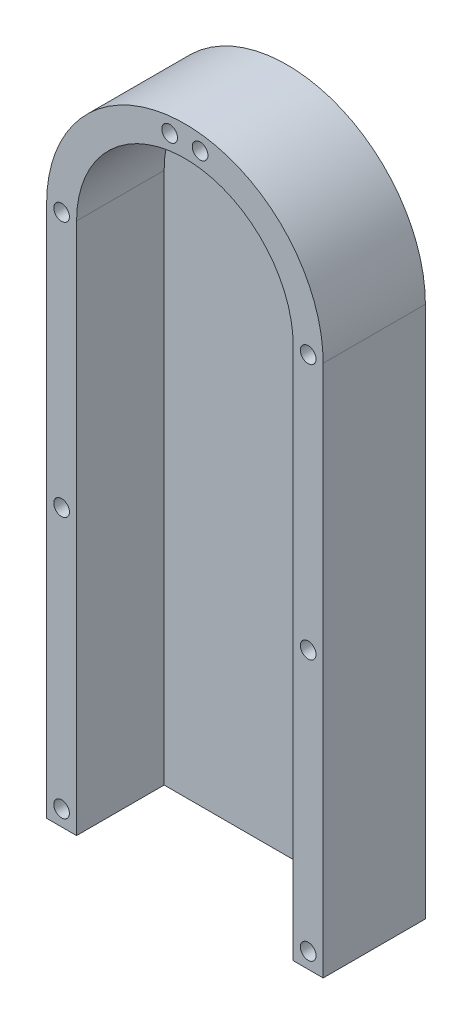
ISO-10303-21;
HEADER;
FILE_DESCRIPTION(('STEP AP214'),'2;1');
FILE_NAME('part.step','',(''),(''),'','','');
FILE_SCHEMA(('AUTOMOTIVE_DESIGN { 1 0 10303 214 1 1 1 1 }'));
ENDSEC;
DATA;
#1=APPLICATION_CONTEXT('core data for automotive mechanical design processes');
#2=APPLICATION_PROTOCOL_DEFINITION('international standard','automotive_design',2000,#1);
#3=PRODUCT_CONTEXT('',#1,'mechanical');
#4=PRODUCT('Part','Part','',(#3));
#5=PRODUCT_RELATED_PRODUCT_CATEGORY('part','',(#4));
#6=PRODUCT_DEFINITION_FORMATION('','',#4);
#7=PRODUCT_DEFINITION_CONTEXT('part definition',#1,'design');
#8=PRODUCT_DEFINITION('design','',#6,#7);
#9=PRODUCT_DEFINITION_SHAPE('','',#8);
#10=(LENGTH_UNIT() NAMED_UNIT(*) SI_UNIT(.MILLI.,.METRE.));
#11=(NAMED_UNIT(*) PLANE_ANGLE_UNIT() SI_UNIT($,.RADIAN.));
#12=(NAMED_UNIT(*) SI_UNIT($,.STERADIAN.) SOLID_ANGLE_UNIT());
#13=UNCERTAINTY_MEASURE_WITH_UNIT(LENGTH_MEASURE(1.E-05),#10,'distance_accuracy_value','');
#14=(GEOMETRIC_REPRESENTATION_CONTEXT(3) GLOBAL_UNCERTAINTY_ASSIGNED_CONTEXT((#13)) GLOBAL_UNIT_ASSIGNED_CONTEXT((#10,
#11,#12)) REPRESENTATION_CONTEXT('',''));
#15=CARTESIAN_POINT('',(0.,0.,0.));
#16=DIRECTION('',(0.,0.,1.));
#17=DIRECTION('',(1.,0.,0.));
#18=AXIS2_PLACEMENT_3D('',#15,#16,#17);
#19=CARTESIAN_POINT('',(24.5827179372451,-59.5829059297929,3.175));
#20=DIRECTION('',(0.,0.,1.));
#21=DIRECTION('',(1.,0.,0.));
#22=AXIS2_PLACEMENT_3D('',#19,#20,#21);
#23=PLANE('',#22);
#24=DIRECTION('',(0.,-1.,0.));
#25=VECTOR('',#24,1.);
#26=CARTESIAN_POINT('',(48.0827179372451,171.394622999198,3.175));
#27=LINE('',#26,#25);
#28=CARTESIAN_POINT('',(48.0827179372451,171.394622999198,3.175));
#29=VERTEX_POINT('',#28);
#30=CARTESIAN_POINT('',(48.0827179372451,55.9058585347025,3.175));
#31=VERTEX_POINT('',#30);
#32=EDGE_CURVE('E48',#29,#31,#27,.T.);
#33=ORIENTED_EDGE('',*,*,#32,.F.);
#34=CARTESIAN_POINT('',(24.5827179372451,171.394622999198,3.175));
#35=DIRECTION('',(0.,0.,-1.));
#36=DIRECTION('',(1.,0.,0.));
#37=AXIS2_PLACEMENT_3D('',#34,#35,#36);
#38=CIRCLE('',#37,23.5);
#39=CARTESIAN_POINT('',(1.08271793724509,171.394622999198,3.175));
#40=VERTEX_POINT('',#39);
#41=EDGE_CURVE('E126',#40,#29,#38,.T.);
#42=ORIENTED_EDGE('',*,*,#41,.F.);
#43=DIRECTION('',(0.,1.,0.));
#44=VECTOR('',#43,1.);
#45=CARTESIAN_POINT('',(1.08271793724509,171.394622999198,3.175));
#46=LINE('',#45,#44);
#47=CARTESIAN_POINT('',(1.08271793724509,55.9058585347025,3.175));
#48=VERTEX_POINT('',#47);
#49=EDGE_CURVE('E53',#48,#40,#46,.T.);
#50=ORIENTED_EDGE('',*,*,#49,.F.);
#51=DIRECTION('',(-1.,0.,0.));
#52=VECTOR('',#51,1.);
#53=CARTESIAN_POINT('',(-5.41728206275491,55.9058585347025,3.175));
#54=LINE('',#53,#52);
#55=EDGE_CURVE('E155',#31,#48,#54,.T.);
#56=ORIENTED_EDGE('',*,*,#55,.F.);
#57=EDGE_LOOP('',(#33,#42,#50,#56));
#58=FACE_BOUND('',#57,.T.);
#59=ADVANCED_FACE('F33',(#58),#23,.T.);
#60=CARTESIAN_POINT('',(24.5827179372451,-59.5829059297929,0.));
#61=DIRECTION('',(0.,0.,1.));
#62=DIRECTION('',(1.,0.,0.));
#63=AXIS2_PLACEMENT_3D('',#60,#61,#62);
#64=PLANE('',#63);
#65=DIRECTION('',(0.,1.,0.));
#66=VECTOR('',#65,1.);
#67=CARTESIAN_POINT('',(54.5827179372451,-59.5829059297929,0.));
#68=LINE('',#67,#66);
#69=CARTESIAN_POINT('',(54.5827179372451,55.9058585347025,0.));
#70=VERTEX_POINT('',#69);
#71=CARTESIAN_POINT('',(54.5827179372451,171.394622999198,0.));
#72=VERTEX_POINT('',#71);
#73=EDGE_CURVE('E183',#70,#72,#68,.T.);
#74=ORIENTED_EDGE('',*,*,#73,.F.);
#75=DIRECTION('',(-1.,0.,0.));
#76=VECTOR('',#75,1.);
#77=CARTESIAN_POINT('',(-5.41728206275491,55.9058585347025,0.));
#78=LINE('',#77,#76);
#79=CARTESIAN_POINT('',(-5.41728206275491,55.9058585347025,0.));
#80=VERTEX_POINT('',#79);
#81=EDGE_CURVE('E156',#70,#80,#78,.T.);
#82=ORIENTED_EDGE('',*,*,#81,.T.);
#83=DIRECTION('',(0.,-1.,0.));
#84=VECTOR('',#83,1.);
#85=CARTESIAN_POINT('',(-5.41728206275491,171.394622999198,0.));
#86=LINE('',#85,#84);
#87=CARTESIAN_POINT('',(-5.41728206275491,171.394622999198,0.));
#88=VERTEX_POINT('',#87);
#89=EDGE_CURVE('E104',#88,#80,#86,.T.);
#90=ORIENTED_EDGE('',*,*,#89,.F.);
#91=CARTESIAN_POINT('',(24.5827179372451,171.394622999198,0.));
#92=DIRECTION('',(0.,0.,1.));
#93=DIRECTION('',(1.,0.,0.));
#94=AXIS2_PLACEMENT_3D('',#91,#92,#93);
#95=CIRCLE('',#94,30.);
#96=EDGE_CURVE('E185',#72,#88,#95,.T.);
#97=ORIENTED_EDGE('',*,*,#96,.F.);
#98=EDGE_LOOP('',(#74,#82,#90,#97));
#99=FACE_BOUND('',#98,.T.);
#100=CARTESIAN_POINT('',(27.8827179372451,197.940291195723,0.));
#101=DIRECTION('',(0.,0.,1.));
#102=DIRECTION('',(1.,0.,0.));
#103=AXIS2_PLACEMENT_3D('',#100,#101,#102);
#104=CIRCLE('',#103,1.70000000000001);
#105=CARTESIAN_POINT('',(29.5827179372451,197.940291195723,0.));
#106=VERTEX_POINT('',#105);
#107=EDGE_CURVE('E180',#106,#106,#104,.T.);
#108=ORIENTED_EDGE('',*,*,#107,.T.);
#109=EDGE_LOOP('',(#108));
#110=FACE_BOUND('',#109,.T.);
#111=CARTESIAN_POINT('',(51.3327179372474,171.3946229992,0.));
#112=DIRECTION('',(0.,0.,1.));
#113=DIRECTION('',(1.,0.,0.));
#114=AXIS2_PLACEMENT_3D('',#111,#112,#113);
#115=CIRCLE('',#114,1.70000000000001);
#116=CARTESIAN_POINT('',(53.0327179372474,171.3946229992,0.));
#117=VERTEX_POINT('',#116);
#118=EDGE_CURVE('E177',#117,#117,#115,.T.);
#119=ORIENTED_EDGE('',*,*,#118,.T.);
#120=EDGE_LOOP('',(#119));
#121=FACE_BOUND('',#120,.T.);
#122=CARTESIAN_POINT('',(-2.1672820627549,59.3058585347025,0.));
#123=DIRECTION('',(0.,0.,1.));
#124=DIRECTION('',(1.,0.,0.));
#125=AXIS2_PLACEMENT_3D('',#122,#123,#124);
#126=CIRCLE('',#125,1.70000000000001);
#127=CARTESIAN_POINT('',(-0.46728206275489,59.3058585347025,0.));
#128=VERTEX_POINT('',#127);
#129=EDGE_CURVE('E174',#128,#128,#126,.T.);
#130=ORIENTED_EDGE('',*,*,#129,.T.);
#131=EDGE_LOOP('',(#130));
#132=FACE_BOUND('',#131,.T.);
#133=CARTESIAN_POINT('',(-2.16728206275266,171.394622999196,0.));
#134=DIRECTION('',(0.,0.,1.));
#135=DIRECTION('',(1.,0.,0.));
#136=AXIS2_PLACEMENT_3D('',#133,#134,#135);
#137=CIRCLE('',#136,1.70000000000001);
#138=CARTESIAN_POINT('',(-0.467282062752642,171.394622999196,0.));
#139=VERTEX_POINT('',#138);
#140=EDGE_CURVE('E171',#139,#139,#137,.T.);
#141=ORIENTED_EDGE('',*,*,#140,.T.);
#142=EDGE_LOOP('',(#141));
#143=FACE_BOUND('',#142,.T.);
#144=CARTESIAN_POINT('',(51.3327179372449,115.905858534703,0.));
#145=DIRECTION('',(0.,0.,1.));
#146=DIRECTION('',(1.,0.,0.));
#147=AXIS2_PLACEMENT_3D('',#144,#145,#146);
#148=CIRCLE('',#147,1.70000000000001);
#149=CARTESIAN_POINT('',(53.0327179372449,115.905858534703,0.));
#150=VERTEX_POINT('',#149);
#151=EDGE_CURVE('E168',#150,#150,#148,.T.);
#152=ORIENTED_EDGE('',*,*,#151,.T.);
#153=EDGE_LOOP('',(#152));
#154=FACE_BOUND('',#153,.T.);
#155=CARTESIAN_POINT('',(-2.16728206275513,115.905858534703,0.));
#156=DIRECTION('',(0.,0.,1.));
#157=DIRECTION('',(1.,0.,0.));
#158=AXIS2_PLACEMENT_3D('',#155,#156,#157);
#159=CIRCLE('',#158,1.70000000000001);
#160=CARTESIAN_POINT('',(-0.467282062755112,115.905858534703,0.));
#161=VERTEX_POINT('',#160);
#162=EDGE_CURVE('E165',#161,#161,#159,.T.);
#163=ORIENTED_EDGE('',*,*,#162,.T.);
#164=EDGE_LOOP('',(#163));
#165=FACE_BOUND('',#164,.T.);
#166=CARTESIAN_POINT('',(21.2827179372451,197.940291195723,0.));
#167=DIRECTION('',(0.,0.,1.));
#168=DIRECTION('',(1.,0.,0.));
#169=AXIS2_PLACEMENT_3D('',#166,#167,#168);
#170=CIRCLE('',#169,1.70000000000001);
#171=CARTESIAN_POINT('',(22.9827179372451,197.940291195723,0.));
#172=VERTEX_POINT('',#171);
#173=EDGE_CURVE('E162',#172,#172,#170,.T.);
#174=ORIENTED_EDGE('',*,*,#173,.T.);
#175=EDGE_LOOP('',(#174));
#176=FACE_BOUND('',#175,.T.);
#177=CARTESIAN_POINT('',(51.3327179372451,59.3058585347025,0.));
#178=DIRECTION('',(0.,0.,1.));
#179=DIRECTION('',(1.,0.,0.));
#180=AXIS2_PLACEMENT_3D('',#177,#178,#179);
#181=CIRCLE('',#180,1.7);
#182=CARTESIAN_POINT('',(53.0327179372451,59.3058585347025,0.));
#183=VERTEX_POINT('',#182);
#184=EDGE_CURVE('E107',#183,#183,#181,.T.);
#185=ORIENTED_EDGE('',*,*,#184,.T.);
#186=EDGE_LOOP('',(#185));
#187=FACE_BOUND('',#186,.T.);
#188=ADVANCED_FACE('F191',(#99,#110,#121,#132,#143,#154,#165,#176,#187),#64,.F.);
#189=CARTESIAN_POINT('',(54.5827179372451,-59.5829059297929,3.175));
#190=DIRECTION('',(-1.,0.,0.));
#191=DIRECTION('',(0.,0.,1.));
#192=AXIS2_PLACEMENT_3D('',#189,#190,#191);
#193=PLANE('',#192);
#194=DIRECTION('',(0.,0.,-1.));
#195=VECTOR('',#194,1.);
#196=CARTESIAN_POINT('',(54.5827179372451,171.394622999198,3.175));
#197=LINE('',#196,#195);
#198=CARTESIAN_POINT('',(54.5827179372451,171.394622999198,22.175));
#199=VERTEX_POINT('',#198);
#200=EDGE_CURVE('E11',#199,#72,#197,.T.);
#201=ORIENTED_EDGE('',*,*,#200,.F.);
#202=DIRECTION('',(0.,1.,0.));
#203=VECTOR('',#202,1.);
#204=CARTESIAN_POINT('',(54.5827179372451,55.9058585347025,22.175));
#205=LINE('',#204,#203);
#206=CARTESIAN_POINT('',(54.5827179372451,55.9058585347025,22.175));
#207=VERTEX_POINT('',#206);
#208=EDGE_CURVE('E140',#207,#199,#205,.T.);
#209=ORIENTED_EDGE('',*,*,#208,.F.);
#210=DIRECTION('',(0.,0.,1.));
#211=VECTOR('',#210,1.);
#212=CARTESIAN_POINT('',(54.5827179372451,55.9058585347025,0.));
#213=LINE('',#212,#211);
#214=EDGE_CURVE('E108',#70,#207,#213,.T.);
#215=ORIENTED_EDGE('',*,*,#214,.F.);
#216=ORIENTED_EDGE('',*,*,#73,.T.);
#217=EDGE_LOOP('',(#201,#209,#215,#216));
#218=FACE_BOUND('',#217,.T.);
#219=ADVANCED_FACE('F35',(#218),#193,.F.);
#220=CARTESIAN_POINT('',(24.5827179372451,171.394622999198,3.175));
#221=DIRECTION('',(0.,0.,-1.));
#222=DIRECTION('',(-1.,0.,0.));
#223=AXIS2_PLACEMENT_3D('',#220,#221,#222);
#224=CYLINDRICAL_SURFACE('',#223,30.);
#225=ORIENTED_EDGE('',*,*,#96,.T.);
#226=DIRECTION('',(0.,0.,-1.));
#227=VECTOR('',#226,1.);
#228=CARTESIAN_POINT('',(-5.41728206275491,171.394622999198,3.175));
#229=LINE('',#228,#227);
#230=CARTESIAN_POINT('',(-5.41728206275491,171.394622999198,22.175));
#231=VERTEX_POINT('',#230);
#232=EDGE_CURVE('E41',#231,#88,#229,.T.);
#233=ORIENTED_EDGE('',*,*,#232,.F.);
#234=CARTESIAN_POINT('',(24.5827179372451,171.394622999198,22.175));
#235=DIRECTION('',(0.,0.,1.));
#236=DIRECTION('',(1.,0.,0.));
#237=AXIS2_PLACEMENT_3D('',#234,#235,#236);
#238=CIRCLE('',#237,30.);
#239=EDGE_CURVE('E124',#199,#231,#238,.T.);
#240=ORIENTED_EDGE('',*,*,#239,.F.);
#241=ORIENTED_EDGE('',*,*,#200,.T.);
#242=EDGE_LOOP('',(#225,#233,#240,#241));
#243=FACE_BOUND('',#242,.T.);
#244=ADVANCED_FACE('F197',(#243),#224,.T.);
#245=CARTESIAN_POINT('',(-5.41728206275491,171.394622999198,3.175));
#246=DIRECTION('',(1.,0.,0.));
#247=DIRECTION('',(0.,0.,-1.));
#248=AXIS2_PLACEMENT_3D('',#245,#246,#247);
#249=PLANE('',#248);
#250=ORIENTED_EDGE('',*,*,#89,.T.);
#251=DIRECTION('',(0.,0.,1.));
#252=VECTOR('',#251,1.);
#253=CARTESIAN_POINT('',(-5.41728206275491,55.9058585347025,0.));
#254=LINE('',#253,#252);
#255=CARTESIAN_POINT('',(-5.41728206275491,55.9058585347025,22.175));
#256=VERTEX_POINT('',#255);
#257=EDGE_CURVE('E97',#80,#256,#254,.T.);
#258=ORIENTED_EDGE('',*,*,#257,.T.);
#259=DIRECTION('',(0.,-1.,0.));
#260=VECTOR('',#259,1.);
#261=CARTESIAN_POINT('',(-5.41728206275491,171.394622999198,22.175));
#262=LINE('',#261,#260);
#263=EDGE_CURVE('E102',#231,#256,#262,.T.);
#264=ORIENTED_EDGE('',*,*,#263,.F.);
#265=ORIENTED_EDGE('',*,*,#232,.T.);
#266=EDGE_LOOP('',(#250,#258,#264,#265));
#267=FACE_BOUND('',#266,.T.);
#268=ADVANCED_FACE('F99',(#267),#249,.F.);
#269=CARTESIAN_POINT('',(27.8827179372451,197.940291195723,3.175));
#270=DIRECTION('',(0.,0.,-1.));
#271=DIRECTION('',(-1.,0.,0.));
#272=AXIS2_PLACEMENT_3D('',#269,#270,#271);
#273=CYLINDRICAL_SURFACE('',#272,1.70000000000001);
#274=ORIENTED_EDGE('',*,*,#107,.F.);
#275=EDGE_LOOP('',(#274));
#276=FACE_BOUND('',#275,.T.);
#277=CARTESIAN_POINT('',(27.8827179372451,197.940291195723,22.175));
#278=DIRECTION('',(0.,0.,1.));
#279=DIRECTION('',(1.,0.,0.));
#280=AXIS2_PLACEMENT_3D('',#277,#278,#279);
#281=CIRCLE('',#280,1.70000000000001);
#282=CARTESIAN_POINT('',(29.5827179372451,197.940291195723,22.175));
#283=VERTEX_POINT('',#282);
#284=EDGE_CURVE('E286',#283,#283,#281,.T.);
#285=ORIENTED_EDGE('',*,*,#284,.T.);
#286=EDGE_LOOP('',(#285));
#287=FACE_BOUND('',#286,.T.);
#288=ADVANCED_FACE('F203',(#276,#287),#273,.F.);
#289=CARTESIAN_POINT('',(51.3327179372474,171.3946229992,3.175));
#290=DIRECTION('',(0.,0.,-1.));
#291=DIRECTION('',(-1.,0.,0.));
#292=AXIS2_PLACEMENT_3D('',#289,#290,#291);
#293=CYLINDRICAL_SURFACE('',#292,1.70000000000001);
#294=ORIENTED_EDGE('',*,*,#118,.F.);
#295=EDGE_LOOP('',(#294));
#296=FACE_BOUND('',#295,.T.);
#297=CARTESIAN_POINT('',(51.3327179372474,171.3946229992,22.175));
#298=DIRECTION('',(0.,0.,1.));
#299=DIRECTION('',(1.,0.,0.));
#300=AXIS2_PLACEMENT_3D('',#297,#298,#299);
#301=CIRCLE('',#300,1.70000000000001);
#302=CARTESIAN_POINT('',(53.0327179372474,171.3946229992,22.175));
#303=VERTEX_POINT('',#302);
#304=EDGE_CURVE('E268',#303,#303,#301,.T.);
#305=ORIENTED_EDGE('',*,*,#304,.T.);
#306=EDGE_LOOP('',(#305));
#307=FACE_BOUND('',#306,.T.);
#308=ADVANCED_FACE('F214',(#296,#307),#293,.F.);
#309=CARTESIAN_POINT('',(-2.1672820627549,59.3058585347025,3.175));
#310=DIRECTION('',(0.,0.,-1.));
#311=DIRECTION('',(-1.,0.,0.));
#312=AXIS2_PLACEMENT_3D('',#309,#310,#311);
#313=CYLINDRICAL_SURFACE('',#312,1.70000000000001);
#314=ORIENTED_EDGE('',*,*,#129,.F.);
#315=EDGE_LOOP('',(#314));
#316=FACE_BOUND('',#315,.T.);
#317=CARTESIAN_POINT('',(-2.1672820627549,59.3058585347025,22.175));
#318=DIRECTION('',(0.,0.,1.));
#319=DIRECTION('',(1.,0.,0.));
#320=AXIS2_PLACEMENT_3D('',#317,#318,#319);
#321=CIRCLE('',#320,1.70000000000002);
#322=CARTESIAN_POINT('',(-0.46728206275489,59.3058585347025,22.175));
#323=VERTEX_POINT('',#322);
#324=EDGE_CURVE('E276',#323,#323,#321,.T.);
#325=ORIENTED_EDGE('',*,*,#324,.T.);
#326=EDGE_LOOP('',(#325));
#327=FACE_BOUND('',#326,.T.);
#328=ADVANCED_FACE('F218',(#316,#327),#313,.F.);
#329=CARTESIAN_POINT('',(-2.16728206275266,171.394622999196,3.175));
#330=DIRECTION('',(0.,0.,-1.));
#331=DIRECTION('',(-1.,0.,0.));
#332=AXIS2_PLACEMENT_3D('',#329,#330,#331);
#333=CYLINDRICAL_SURFACE('',#332,1.70000000000001);
#334=ORIENTED_EDGE('',*,*,#140,.F.);
#335=EDGE_LOOP('',(#334));
#336=FACE_BOUND('',#335,.T.);
#337=CARTESIAN_POINT('',(-2.16728206275266,171.394622999196,22.175));
#338=DIRECTION('',(0.,0.,1.));
#339=DIRECTION('',(1.,0.,0.));
#340=AXIS2_PLACEMENT_3D('',#337,#338,#339);
#341=CIRCLE('',#340,1.70000000000002);
#342=CARTESIAN_POINT('',(-0.467282062752642,171.394622999196,22.175));
#343=VERTEX_POINT('',#342);
#344=EDGE_CURVE('E290',#343,#343,#341,.T.);
#345=ORIENTED_EDGE('',*,*,#344,.T.);
#346=EDGE_LOOP('',(#345));
#347=FACE_BOUND('',#346,.T.);
#348=ADVANCED_FACE('F222',(#336,#347),#333,.F.);
#349=CARTESIAN_POINT('',(51.3327179372449,115.905858534703,3.175));
#350=DIRECTION('',(0.,0.,-1.));
#351=DIRECTION('',(-1.,0.,0.));
#352=AXIS2_PLACEMENT_3D('',#349,#350,#351);
#353=CYLINDRICAL_SURFACE('',#352,1.70000000000001);
#354=ORIENTED_EDGE('',*,*,#151,.F.);
#355=EDGE_LOOP('',(#354));
#356=FACE_BOUND('',#355,.T.);
#357=CARTESIAN_POINT('',(51.3327179372449,115.905858534703,22.175));
#358=DIRECTION('',(0.,0.,1.));
#359=DIRECTION('',(1.,0.,0.));
#360=AXIS2_PLACEMENT_3D('',#357,#358,#359);
#361=CIRCLE('',#360,1.70000000000001);
#362=CARTESIAN_POINT('',(53.0327179372449,115.905858534703,22.175));
#363=VERTEX_POINT('',#362);
#364=EDGE_CURVE('E280',#363,#363,#361,.T.);
#365=ORIENTED_EDGE('',*,*,#364,.T.);
#366=EDGE_LOOP('',(#365));
#367=FACE_BOUND('',#366,.T.);
#368=ADVANCED_FACE('F226',(#356,#367),#353,.F.);
#369=CARTESIAN_POINT('',(-2.16728206275513,115.905858534703,3.175));
#370=DIRECTION('',(0.,0.,-1.));
#371=DIRECTION('',(-1.,0.,0.));
#372=AXIS2_PLACEMENT_3D('',#369,#370,#371);
#373=CYLINDRICAL_SURFACE('',#372,1.70000000000001);
#374=ORIENTED_EDGE('',*,*,#162,.F.);
#375=EDGE_LOOP('',(#374));
#376=FACE_BOUND('',#375,.T.);
#377=CARTESIAN_POINT('',(-2.16728206275513,115.905858534703,22.175));
#378=DIRECTION('',(0.,0.,1.));
#379=DIRECTION('',(1.,0.,0.));
#380=AXIS2_PLACEMENT_3D('',#377,#378,#379);
#381=CIRCLE('',#380,1.70000000000002);
#382=CARTESIAN_POINT('',(-0.467282062755112,115.905858534703,22.175));
#383=VERTEX_POINT('',#382);
#384=EDGE_CURVE('E129',#383,#383,#381,.T.);
#385=ORIENTED_EDGE('',*,*,#384,.T.);
#386=EDGE_LOOP('',(#385));
#387=FACE_BOUND('',#386,.T.);
#388=ADVANCED_FACE('F230',(#376,#387),#373,.F.);
#389=CARTESIAN_POINT('',(21.2827179372451,197.940291195723,3.175));
#390=DIRECTION('',(0.,0.,-1.));
#391=DIRECTION('',(-1.,0.,0.));
#392=AXIS2_PLACEMENT_3D('',#389,#390,#391);
#393=CYLINDRICAL_SURFACE('',#392,1.70000000000001);
#394=ORIENTED_EDGE('',*,*,#173,.F.);
#395=EDGE_LOOP('',(#394));
#396=FACE_BOUND('',#395,.T.);
#397=CARTESIAN_POINT('',(21.2827179372451,197.940291195723,22.175));
#398=DIRECTION('',(0.,0.,1.));
#399=DIRECTION('',(1.,0.,0.));
#400=AXIS2_PLACEMENT_3D('',#397,#398,#399);
#401=CIRCLE('',#400,1.70000000000001);
#402=CARTESIAN_POINT('',(22.9827179372451,197.940291195723,22.175));
#403=VERTEX_POINT('',#402);
#404=EDGE_CURVE('E264',#403,#403,#401,.T.);
#405=ORIENTED_EDGE('',*,*,#404,.T.);
#406=EDGE_LOOP('',(#405));
#407=FACE_BOUND('',#406,.T.);
#408=ADVANCED_FACE('F234',(#396,#407),#393,.F.);
#409=CARTESIAN_POINT('',(51.3327179372451,59.3058585347025,3.175));
#410=DIRECTION('',(0.,0.,-1.));
#411=DIRECTION('',(-1.,0.,0.));
#412=AXIS2_PLACEMENT_3D('',#409,#410,#411);
#413=CYLINDRICAL_SURFACE('',#412,1.7);
#414=ORIENTED_EDGE('',*,*,#184,.F.);
#415=EDGE_LOOP('',(#414));
#416=FACE_BOUND('',#415,.T.);
#417=CARTESIAN_POINT('',(51.3327179372451,59.3058585347025,22.175));
#418=DIRECTION('',(0.,0.,1.));
#419=DIRECTION('',(1.,0.,0.));
#420=AXIS2_PLACEMENT_3D('',#417,#418,#419);
#421=CIRCLE('',#420,1.7);
#422=CARTESIAN_POINT('',(53.0327179372451,59.3058585347025,22.175));
#423=VERTEX_POINT('',#422);
#424=EDGE_CURVE('E272',#423,#423,#421,.T.);
#425=ORIENTED_EDGE('',*,*,#424,.T.);
#426=EDGE_LOOP('',(#425));
#427=FACE_BOUND('',#426,.T.);
#428=ADVANCED_FACE('F238',(#416,#427),#413,.F.);
#429=CARTESIAN_POINT('',(-5.41728206275491,55.9058585347025,0.));
#430=DIRECTION('',(0.,1.,0.));
#431=DIRECTION('',(-1.,0.,0.));
#432=AXIS2_PLACEMENT_3D('',#429,#430,#431);
#433=PLANE('',#432);
#434=ORIENTED_EDGE('',*,*,#214,.T.);
#435=DIRECTION('',(1.,0.,0.));
#436=VECTOR('',#435,1.);
#437=CARTESIAN_POINT('',(48.0827179372451,55.9058585347025,22.175));
#438=LINE('',#437,#436);
#439=CARTESIAN_POINT('',(48.0827179372451,55.9058585347025,22.175));
#440=VERTEX_POINT('',#439);
#441=EDGE_CURVE('E137',#440,#207,#438,.T.);
#442=ORIENTED_EDGE('',*,*,#441,.F.);
#443=DIRECTION('',(0.,0.,-1.));
#444=VECTOR('',#443,1.);
#445=CARTESIAN_POINT('',(48.0827179372451,55.9058585347025,22.175));
#446=LINE('',#445,#444);
#447=EDGE_CURVE('E143',#440,#31,#446,.T.);
#448=ORIENTED_EDGE('',*,*,#447,.T.);
#449=ORIENTED_EDGE('',*,*,#55,.T.);
#450=DIRECTION('',(0.,0.,-1.));
#451=VECTOR('',#450,1.);
#452=CARTESIAN_POINT('',(1.08271793724509,55.9058585347025,22.175));
#453=LINE('',#452,#451);
#454=CARTESIAN_POINT('',(1.08271793724509,55.9058585347025,22.175));
#455=VERTEX_POINT('',#454);
#456=EDGE_CURVE('E114',#455,#48,#453,.T.);
#457=ORIENTED_EDGE('',*,*,#456,.F.);
#458=DIRECTION('',(1.,0.,0.));
#459=VECTOR('',#458,1.);
#460=CARTESIAN_POINT('',(-5.41728206275491,55.9058585347025,22.175));
#461=LINE('',#460,#459);
#462=EDGE_CURVE('E111',#256,#455,#461,.T.);
#463=ORIENTED_EDGE('',*,*,#462,.F.);
#464=ORIENTED_EDGE('',*,*,#257,.F.);
#465=ORIENTED_EDGE('',*,*,#81,.F.);
#466=EDGE_LOOP('',(#434,#442,#448,#449,#457,#463,#464,#465));
#467=FACE_BOUND('',#466,.T.);
#468=ADVANCED_FACE('F112',(#467),#433,.F.);
#469=CARTESIAN_POINT('',(24.5827179372451,171.394622999198,22.175));
#470=DIRECTION('',(0.,0.,1.));
#471=DIRECTION('',(1.,0.,0.));
#472=AXIS2_PLACEMENT_3D('',#469,#470,#471);
#473=PLANE('',#472);
#474=ORIENTED_EDGE('',*,*,#404,.F.);
#475=EDGE_LOOP('',(#474));
#476=FACE_BOUND('',#475,.T.);
#477=ORIENTED_EDGE('',*,*,#304,.F.);
#478=EDGE_LOOP('',(#477));
#479=FACE_BOUND('',#478,.T.);
#480=ORIENTED_EDGE('',*,*,#424,.F.);
#481=EDGE_LOOP('',(#480));
#482=FACE_BOUND('',#481,.T.);
#483=ORIENTED_EDGE('',*,*,#384,.F.);
#484=EDGE_LOOP('',(#483));
#485=FACE_BOUND('',#484,.T.);
#486=ORIENTED_EDGE('',*,*,#263,.T.);
#487=ORIENTED_EDGE('',*,*,#462,.T.);
#488=DIRECTION('',(0.,1.,0.));
#489=VECTOR('',#488,1.);
#490=CARTESIAN_POINT('',(1.08271793724509,171.394622999198,22.175));
#491=LINE('',#490,#489);
#492=CARTESIAN_POINT('',(1.08271793724509,171.394622999198,22.175));
#493=VERTEX_POINT('',#492);
#494=EDGE_CURVE('E117',#455,#493,#491,.T.);
#495=ORIENTED_EDGE('',*,*,#494,.T.);
#496=CARTESIAN_POINT('',(24.5827179372451,171.394622999198,22.175));
#497=DIRECTION('',(0.,0.,-1.));
#498=DIRECTION('',(1.,0.,0.));
#499=AXIS2_PLACEMENT_3D('',#496,#497,#498);
#500=CIRCLE('',#499,23.5);
#501=CARTESIAN_POINT('',(48.0827179372451,171.394622999198,22.175));
#502=VERTEX_POINT('',#501);
#503=EDGE_CURVE('E133',#493,#502,#500,.T.);
#504=ORIENTED_EDGE('',*,*,#503,.T.);
#505=DIRECTION('',(0.,-1.,0.));
#506=VECTOR('',#505,1.);
#507=CARTESIAN_POINT('',(48.0827179372451,171.394622999198,22.175));
#508=LINE('',#507,#506);
#509=EDGE_CURVE('E135',#502,#440,#508,.T.);
#510=ORIENTED_EDGE('',*,*,#509,.T.);
#511=ORIENTED_EDGE('',*,*,#441,.T.);
#512=ORIENTED_EDGE('',*,*,#208,.T.);
#513=ORIENTED_EDGE('',*,*,#239,.T.);
#514=EDGE_LOOP('',(#486,#487,#495,#504,#510,#511,#512,#513));
#515=FACE_BOUND('',#514,.T.);
#516=ORIENTED_EDGE('',*,*,#324,.F.);
#517=EDGE_LOOP('',(#516));
#518=FACE_BOUND('',#517,.T.);
#519=ORIENTED_EDGE('',*,*,#364,.F.);
#520=EDGE_LOOP('',(#519));
#521=FACE_BOUND('',#520,.T.);
#522=ORIENTED_EDGE('',*,*,#284,.F.);
#523=EDGE_LOOP('',(#522));
#524=FACE_BOUND('',#523,.T.);
#525=ORIENTED_EDGE('',*,*,#344,.F.);
#526=EDGE_LOOP('',(#525));
#527=FACE_BOUND('',#526,.T.);
#528=ADVANCED_FACE('F120',(#476,#479,#482,#485,#515,#518,#521,#524,#527),#473,.T.);
#529=CARTESIAN_POINT('',(1.08271793724509,171.394622999198,22.175));
#530=DIRECTION('',(-1.,0.,0.));
#531=DIRECTION('',(0.,0.,1.));
#532=AXIS2_PLACEMENT_3D('',#529,#530,#531);
#533=PLANE('',#532);
#534=ORIENTED_EDGE('',*,*,#49,.T.);
#535=DIRECTION('',(0.,0.,-1.));
#536=VECTOR('',#535,1.);
#537=CARTESIAN_POINT('',(1.08271793724509,171.394622999198,22.175));
#538=LINE('',#537,#536);
#539=EDGE_CURVE('E151',#493,#40,#538,.T.);
#540=ORIENTED_EDGE('',*,*,#539,.F.);
#541=ORIENTED_EDGE('',*,*,#494,.F.);
#542=ORIENTED_EDGE('',*,*,#456,.T.);
#543=EDGE_LOOP('',(#534,#540,#541,#542));
#544=FACE_BOUND('',#543,.T.);
#545=ADVANCED_FACE('F245',(#544),#533,.F.);
#546=CARTESIAN_POINT('',(24.5827179372451,171.394622999198,22.175));
#547=DIRECTION('',(0.,0.,-1.));
#548=DIRECTION('',(-1.,0.,0.));
#549=AXIS2_PLACEMENT_3D('',#546,#547,#548);
#550=CYLINDRICAL_SURFACE('',#549,23.5);
#551=ORIENTED_EDGE('',*,*,#41,.T.);
#552=DIRECTION('',(0.,0.,-1.));
#553=VECTOR('',#552,1.);
#554=CARTESIAN_POINT('',(48.0827179372451,171.394622999198,22.175));
#555=LINE('',#554,#553);
#556=EDGE_CURVE('E148',#502,#29,#555,.T.);
#557=ORIENTED_EDGE('',*,*,#556,.F.);
#558=ORIENTED_EDGE('',*,*,#503,.F.);
#559=ORIENTED_EDGE('',*,*,#539,.T.);
#560=EDGE_LOOP('',(#551,#557,#558,#559));
#561=FACE_BOUND('',#560,.T.);
#562=ADVANCED_FACE('F248',(#561),#550,.F.);
#563=CARTESIAN_POINT('',(48.0827179372451,171.394622999198,22.175));
#564=DIRECTION('',(1.,0.,0.));
#565=DIRECTION('',(0.,0.,-1.));
#566=AXIS2_PLACEMENT_3D('',#563,#564,#565);
#567=PLANE('',#566);
#568=ORIENTED_EDGE('',*,*,#32,.T.);
#569=ORIENTED_EDGE('',*,*,#447,.F.);
#570=ORIENTED_EDGE('',*,*,#509,.F.);
#571=ORIENTED_EDGE('',*,*,#556,.T.);
#572=EDGE_LOOP('',(#568,#569,#570,#571));
#573=FACE_BOUND('',#572,.T.);
#574=ADVANCED_FACE('F252',(#573),#567,.F.);
#575=CLOSED_SHELL('',(#59,#188,#219,#244,#268,#288,#308,#328,#348,#368,#388,#408,#428,#468,#528,
#545,#562,#574));
#576=MANIFOLD_SOLID_BREP('B2',#575);
#577=ADVANCED_BREP_SHAPE_REPRESENTATION('',(#18,#576),#14);
#578=SHAPE_DEFINITION_REPRESENTATION(#9,#577);
ENDSEC;
END-ISO-10303-21;
